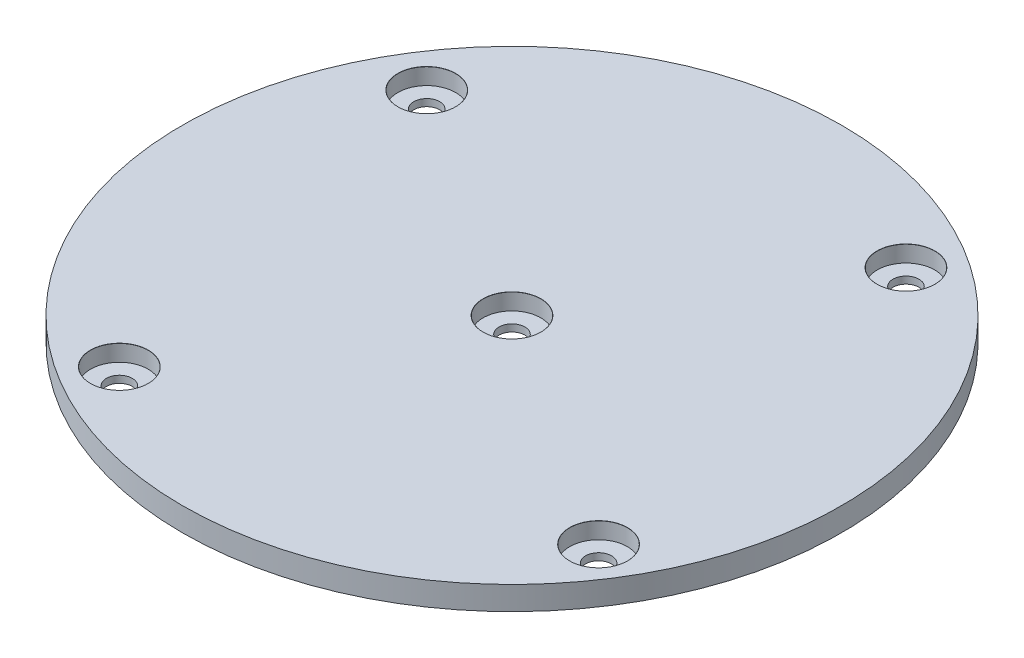
ISO-10303-21;
HEADER;
FILE_DESCRIPTION(('STEP AP214'),'2;1');
FILE_NAME('part.step','',(''),(''),'','','');
FILE_SCHEMA(('AUTOMOTIVE_DESIGN { 1 0 10303 214 1 1 1 1 }'));
ENDSEC;
DATA;
#1=APPLICATION_CONTEXT('core data for automotive mechanical design processes');
#2=APPLICATION_PROTOCOL_DEFINITION('international standard','automotive_design',2000,#1);
#3=PRODUCT_CONTEXT('',#1,'mechanical');
#4=PRODUCT('Part','Part','',(#3));
#5=PRODUCT_RELATED_PRODUCT_CATEGORY('part','',(#4));
#6=PRODUCT_DEFINITION_FORMATION('','',#4);
#7=PRODUCT_DEFINITION_CONTEXT('part definition',#1,'design');
#8=PRODUCT_DEFINITION('design','',#6,#7);
#9=PRODUCT_DEFINITION_SHAPE('','',#8);
#10=(LENGTH_UNIT() NAMED_UNIT(*) SI_UNIT(.MILLI.,.METRE.));
#11=(NAMED_UNIT(*) PLANE_ANGLE_UNIT() SI_UNIT($,.RADIAN.));
#12=(NAMED_UNIT(*) SI_UNIT($,.STERADIAN.) SOLID_ANGLE_UNIT());
#13=UNCERTAINTY_MEASURE_WITH_UNIT(LENGTH_MEASURE(1.E-05),#10,'distance_accuracy_value','');
#14=(GEOMETRIC_REPRESENTATION_CONTEXT(3) GLOBAL_UNCERTAINTY_ASSIGNED_CONTEXT((#13)) GLOBAL_UNIT_ASSIGNED_CONTEXT((#10,
#11,#12)) REPRESENTATION_CONTEXT('',''));
#15=CARTESIAN_POINT('',(0.,0.,0.));
#16=DIRECTION('',(0.,0.,1.));
#17=DIRECTION('',(1.,0.,0.));
#18=AXIS2_PLACEMENT_3D('',#15,#16,#17);
#19=CARTESIAN_POINT('',(0.,5.,0.));
#20=DIRECTION('',(0.,-1.,0.));
#21=DIRECTION('',(0.,0.,-1.));
#22=AXIS2_PLACEMENT_3D('',#19,#20,#21);
#23=CYLINDRICAL_SURFACE('',#22,70.);
#24=CARTESIAN_POINT('',(0.,5.,0.));
#25=DIRECTION('',(0.,1.,0.));
#26=DIRECTION('',(0.,0.,1.));
#27=AXIS2_PLACEMENT_3D('',#24,#25,#26);
#28=CIRCLE('',#27,70.);
#29=CARTESIAN_POINT('',(0.,5.,70.));
#30=VERTEX_POINT('',#29);
#31=EDGE_CURVE('E10',#30,#30,#28,.T.);
#32=ORIENTED_EDGE('',*,*,#31,.F.);
#33=EDGE_LOOP('',(#32));
#34=FACE_BOUND('',#33,.T.);
#35=CARTESIAN_POINT('',(0.,0.,0.));
#36=DIRECTION('',(0.,1.,0.));
#37=DIRECTION('',(0.,0.,1.));
#38=AXIS2_PLACEMENT_3D('',#35,#36,#37);
#39=CIRCLE('',#38,70.);
#40=CARTESIAN_POINT('',(0.,0.,70.));
#41=VERTEX_POINT('',#40);
#42=EDGE_CURVE('E40',#41,#41,#39,.T.);
#43=ORIENTED_EDGE('',*,*,#42,.T.);
#44=EDGE_LOOP('',(#43));
#45=FACE_BOUND('',#44,.T.);
#46=ADVANCED_FACE('F37',(#34,#45),#23,.T.);
#47=CARTESIAN_POINT('',(0.,5.,0.));
#48=DIRECTION('',(0.,1.,0.));
#49=DIRECTION('',(0.,0.,1.));
#50=AXIS2_PLACEMENT_3D('',#47,#48,#49);
#51=PLANE('',#50);
#52=CARTESIAN_POINT('',(0.,5.,0.));
#53=DIRECTION('',(0.,1.,0.));
#54=DIRECTION('',(0.,0.,1.));
#55=AXIS2_PLACEMENT_3D('',#52,#53,#54);
#56=CIRCLE('',#55,6.144);
#57=CARTESIAN_POINT('',(0.,5.,6.144));
#58=VERTEX_POINT('',#57);
#59=EDGE_CURVE('E120',#58,#58,#56,.T.);
#60=ORIENTED_EDGE('',*,*,#59,.F.);
#61=EDGE_LOOP('',(#60));
#62=FACE_BOUND('',#61,.T.);
#63=CARTESIAN_POINT('',(33.0392274204938,5.,-50.6432777799071));
#64=DIRECTION('',(0.,1.,0.));
#65=DIRECTION('',(0.,0.,1.));
#66=AXIS2_PLACEMENT_3D('',#63,#64,#65);
#67=CIRCLE('',#66,6.144);
#68=CARTESIAN_POINT('',(33.0392274204938,5.,-44.4992777799071));
#69=VERTEX_POINT('',#68);
#70=EDGE_CURVE('E105',#69,#69,#67,.T.);
#71=ORIENTED_EDGE('',*,*,#70,.F.);
#72=EDGE_LOOP('',(#71));
#73=FACE_BOUND('',#72,.T.);
#74=CARTESIAN_POINT('',(51.2868700670209,5.,32.8986507990891));
#75=DIRECTION('',(0.,1.,0.));
#76=DIRECTION('',(0.,0.,1.));
#77=AXIS2_PLACEMENT_3D('',#74,#75,#76);
#78=CIRCLE('',#77,6.144);
#79=CARTESIAN_POINT('',(51.2868700670209,5.,39.0426507990891));
#80=VERTEX_POINT('',#79);
#81=EDGE_CURVE('E90',#80,#80,#78,.T.);
#82=ORIENTED_EDGE('',*,*,#81,.F.);
#83=EDGE_LOOP('',(#82));
#84=FACE_BOUND('',#83,.T.);
#85=CARTESIAN_POINT('',(-32.2550585119747,5.,51.1462934456157));
#86=DIRECTION('',(0.,1.,0.));
#87=DIRECTION('',(0.,0.,1.));
#88=AXIS2_PLACEMENT_3D('',#85,#86,#87);
#89=CIRCLE('',#88,6.144);
#90=CARTESIAN_POINT('',(-32.2550585119747,5.,57.2902934456157));
#91=VERTEX_POINT('',#90);
#92=EDGE_CURVE('E75',#91,#91,#89,.T.);
#93=ORIENTED_EDGE('',*,*,#92,.F.);
#94=EDGE_LOOP('',(#93));
#95=FACE_BOUND('',#94,.T.);
#96=CARTESIAN_POINT('',(-50.5027011585014,5.,-32.3956351333802));
#97=DIRECTION('',(0.,1.,0.));
#98=DIRECTION('',(0.,0.,1.));
#99=AXIS2_PLACEMENT_3D('',#96,#97,#98);
#100=CIRCLE('',#99,6.144);
#101=CARTESIAN_POINT('',(-50.5027011585014,5.,-26.2516351333802));
#102=VERTEX_POINT('',#101);
#103=EDGE_CURVE('E60',#102,#102,#100,.T.);
#104=ORIENTED_EDGE('',*,*,#103,.F.);
#105=EDGE_LOOP('',(#104));
#106=FACE_BOUND('',#105,.T.);
#107=ORIENTED_EDGE('',*,*,#31,.T.);
#108=EDGE_LOOP('',(#107));
#109=FACE_BOUND('',#108,.T.);
#110=ADVANCED_FACE('F126',(#62,#73,#84,#95,#106,#109),#51,.T.);
#111=CARTESIAN_POINT('',(0.,0.,0.));
#112=DIRECTION('',(0.,1.,0.));
#113=DIRECTION('',(0.,0.,1.));
#114=AXIS2_PLACEMENT_3D('',#111,#112,#113);
#115=PLANE('',#114);
#116=CARTESIAN_POINT('',(0.,0.,0.));
#117=DIRECTION('',(0.,1.,0.));
#118=DIRECTION('',(0.,0.,1.));
#119=AXIS2_PLACEMENT_3D('',#116,#117,#118);
#120=CIRCLE('',#119,2.75);
#121=CARTESIAN_POINT('',(0.,0.,2.75));
#122=VERTEX_POINT('',#121);
#123=EDGE_CURVE('E108',#122,#122,#120,.T.);
#124=ORIENTED_EDGE('',*,*,#123,.T.);
#125=EDGE_LOOP('',(#124));
#126=FACE_BOUND('',#125,.T.);
#127=CARTESIAN_POINT('',(33.0392274204938,0.,-50.6432777799071));
#128=DIRECTION('',(0.,1.,0.));
#129=DIRECTION('',(0.,0.,1.));
#130=AXIS2_PLACEMENT_3D('',#127,#128,#129);
#131=CIRCLE('',#130,2.75);
#132=CARTESIAN_POINT('',(33.0392274204938,0.,-47.8932777799071));
#133=VERTEX_POINT('',#132);
#134=EDGE_CURVE('E93',#133,#133,#131,.T.);
#135=ORIENTED_EDGE('',*,*,#134,.T.);
#136=EDGE_LOOP('',(#135));
#137=FACE_BOUND('',#136,.T.);
#138=CARTESIAN_POINT('',(51.2868700670209,0.,32.8986507990891));
#139=DIRECTION('',(0.,1.,0.));
#140=DIRECTION('',(0.,0.,1.));
#141=AXIS2_PLACEMENT_3D('',#138,#139,#140);
#142=CIRCLE('',#141,2.75);
#143=CARTESIAN_POINT('',(51.2868700670209,0.,35.6486507990891));
#144=VERTEX_POINT('',#143);
#145=EDGE_CURVE('E78',#144,#144,#142,.T.);
#146=ORIENTED_EDGE('',*,*,#145,.T.);
#147=EDGE_LOOP('',(#146));
#148=FACE_BOUND('',#147,.T.);
#149=CARTESIAN_POINT('',(-32.2550585119747,0.,51.1462934456157));
#150=DIRECTION('',(0.,1.,0.));
#151=DIRECTION('',(0.,0.,1.));
#152=AXIS2_PLACEMENT_3D('',#149,#150,#151);
#153=CIRCLE('',#152,2.75);
#154=CARTESIAN_POINT('',(-32.2550585119747,0.,53.8962934456157));
#155=VERTEX_POINT('',#154);
#156=EDGE_CURVE('E63',#155,#155,#153,.T.);
#157=ORIENTED_EDGE('',*,*,#156,.T.);
#158=EDGE_LOOP('',(#157));
#159=FACE_BOUND('',#158,.T.);
#160=CARTESIAN_POINT('',(-50.5027011585014,0.,-32.3956351333802));
#161=DIRECTION('',(0.,1.,0.));
#162=DIRECTION('',(0.,0.,1.));
#163=AXIS2_PLACEMENT_3D('',#160,#161,#162);
#164=CIRCLE('',#163,2.75);
#165=CARTESIAN_POINT('',(-50.5027011585014,0.,-29.6456351333802));
#166=VERTEX_POINT('',#165);
#167=EDGE_CURVE('E47',#166,#166,#164,.T.);
#168=ORIENTED_EDGE('',*,*,#167,.T.);
#169=EDGE_LOOP('',(#168));
#170=FACE_BOUND('',#169,.T.);
#171=ORIENTED_EDGE('',*,*,#42,.F.);
#172=EDGE_LOOP('',(#171));
#173=FACE_BOUND('',#172,.T.);
#174=ADVANCED_FACE('F129',(#126,#137,#148,#159,#170,#173),#115,.F.);
#175=CARTESIAN_POINT('',(-50.5027011585014,5.,-32.3956351333802));
#176=DIRECTION('',(0.,1.,0.));
#177=DIRECTION('',(0.,0.,1.));
#178=AXIS2_PLACEMENT_3D('',#175,#176,#177);
#179=CYLINDRICAL_SURFACE('',#178,2.75);
#180=ORIENTED_EDGE('',*,*,#167,.F.);
#181=EDGE_LOOP('',(#180));
#182=FACE_BOUND('',#181,.T.);
#183=CARTESIAN_POINT('',(-50.5027011585014,1.5,-32.3956351333802));
#184=DIRECTION('',(0.,1.,0.));
#185=DIRECTION('',(0.,0.,1.));
#186=AXIS2_PLACEMENT_3D('',#183,#184,#185);
#187=CIRCLE('',#186,2.75);
#188=CARTESIAN_POINT('',(-50.5027011585014,1.5,-29.6456351333802));
#189=VERTEX_POINT('',#188);
#190=EDGE_CURVE('E51',#189,#189,#187,.T.);
#191=ORIENTED_EDGE('',*,*,#190,.T.);
#192=EDGE_LOOP('',(#191));
#193=FACE_BOUND('',#192,.T.);
#194=ADVANCED_FACE('F165',(#182,#193),#179,.F.);
#195=CARTESIAN_POINT('',(-44.3837011585014,1.5,-32.3956351333802));
#196=DIRECTION('',(0.,-1.,0.));
#197=DIRECTION('',(0.,0.,-1.));
#198=AXIS2_PLACEMENT_3D('',#195,#196,#197);
#199=PLANE('',#198);
#200=ORIENTED_EDGE('',*,*,#190,.F.);
#201=EDGE_LOOP('',(#200));
#202=FACE_BOUND('',#201,.T.);
#203=CARTESIAN_POINT('',(-50.5027011585014,1.5,-32.3956351333802));
#204=DIRECTION('',(0.,1.,0.));
#205=DIRECTION('',(0.,0.,1.));
#206=AXIS2_PLACEMENT_3D('',#203,#204,#205);
#207=CIRCLE('',#206,6.119);
#208=CARTESIAN_POINT('',(-50.5027011585014,1.5,-26.2766351333802));
#209=VERTEX_POINT('',#208);
#210=EDGE_CURVE('E54',#209,#209,#207,.T.);
#211=ORIENTED_EDGE('',*,*,#210,.T.);
#212=EDGE_LOOP('',(#211));
#213=FACE_BOUND('',#212,.T.);
#214=ADVANCED_FACE('F152',(#202,#213),#199,.F.);
#215=CARTESIAN_POINT('',(-50.5027011585014,5.,-32.3956351333802));
#216=DIRECTION('',(0.,1.,0.));
#217=DIRECTION('',(0.,0.,1.));
#218=AXIS2_PLACEMENT_3D('',#215,#216,#217);
#219=CYLINDRICAL_SURFACE('',#218,6.119);
#220=ORIENTED_EDGE('',*,*,#210,.F.);
#221=EDGE_LOOP('',(#220));
#222=FACE_BOUND('',#221,.T.);
#223=CARTESIAN_POINT('',(-50.5027011585014,4.975,-32.3956351333802));
#224=DIRECTION('',(0.,1.,0.));
#225=DIRECTION('',(0.,0.,1.));
#226=AXIS2_PLACEMENT_3D('',#223,#224,#225);
#227=CIRCLE('',#226,6.119);
#228=CARTESIAN_POINT('',(-50.5027011585014,4.975,-26.2766351333802));
#229=VERTEX_POINT('',#228);
#230=EDGE_CURVE('E57',#229,#229,#227,.T.);
#231=ORIENTED_EDGE('',*,*,#230,.T.);
#232=EDGE_LOOP('',(#231));
#233=FACE_BOUND('',#232,.T.);
#234=ADVANCED_FACE('F142',(#222,#233),#219,.F.);
#235=CARTESIAN_POINT('',(-50.5027011585014,5.,-32.3956351333802));
#236=DIRECTION('',(0.,1.,0.));
#237=DIRECTION('',(0.,0.,1.));
#238=AXIS2_PLACEMENT_3D('',#235,#236,#237);
#239=CONICAL_SURFACE('',#238,6.144,0.785398163397431);
#240=ORIENTED_EDGE('',*,*,#230,.F.);
#241=EDGE_LOOP('',(#240));
#242=FACE_BOUND('',#241,.T.);
#243=ORIENTED_EDGE('',*,*,#103,.T.);
#244=EDGE_LOOP('',(#243));
#245=FACE_BOUND('',#244,.T.);
#246=ADVANCED_FACE('F139',(#242,#245),#239,.F.);
#247=CARTESIAN_POINT('',(-32.2550585119747,5.,51.1462934456157));
#248=DIRECTION('',(0.,1.,0.));
#249=DIRECTION('',(0.,0.,1.));
#250=AXIS2_PLACEMENT_3D('',#247,#248,#249);
#251=CYLINDRICAL_SURFACE('',#250,2.75);
#252=ORIENTED_EDGE('',*,*,#156,.F.);
#253=EDGE_LOOP('',(#252));
#254=FACE_BOUND('',#253,.T.);
#255=CARTESIAN_POINT('',(-32.2550585119747,1.5,51.1462934456157));
#256=DIRECTION('',(0.,1.,0.));
#257=DIRECTION('',(0.,0.,1.));
#258=AXIS2_PLACEMENT_3D('',#255,#256,#257);
#259=CIRCLE('',#258,2.75);
#260=CARTESIAN_POINT('',(-32.2550585119747,1.5,53.8962934456157));
#261=VERTEX_POINT('',#260);
#262=EDGE_CURVE('E66',#261,#261,#259,.T.);
#263=ORIENTED_EDGE('',*,*,#262,.T.);
#264=EDGE_LOOP('',(#263));
#265=FACE_BOUND('',#264,.T.);
#266=ADVANCED_FACE('F141',(#254,#265),#251,.F.);
#267=CARTESIAN_POINT('',(-26.1360585119747,1.5,51.1462934456157));
#268=DIRECTION('',(0.,-1.,0.));
#269=DIRECTION('',(0.,0.,-1.));
#270=AXIS2_PLACEMENT_3D('',#267,#268,#269);
#271=PLANE('',#270);
#272=ORIENTED_EDGE('',*,*,#262,.F.);
#273=EDGE_LOOP('',(#272));
#274=FACE_BOUND('',#273,.T.);
#275=CARTESIAN_POINT('',(-32.2550585119747,1.5,51.1462934456157));
#276=DIRECTION('',(0.,1.,0.));
#277=DIRECTION('',(0.,0.,1.));
#278=AXIS2_PLACEMENT_3D('',#275,#276,#277);
#279=CIRCLE('',#278,6.119);
#280=CARTESIAN_POINT('',(-32.2550585119747,1.5,57.2652934456157));
#281=VERTEX_POINT('',#280);
#282=EDGE_CURVE('E69',#281,#281,#279,.T.);
#283=ORIENTED_EDGE('',*,*,#282,.T.);
#284=EDGE_LOOP('',(#283));
#285=FACE_BOUND('',#284,.T.);
#286=ADVANCED_FACE('F149',(#274,#285),#271,.F.);
#287=CARTESIAN_POINT('',(-32.2550585119747,5.,51.1462934456157));
#288=DIRECTION('',(0.,1.,0.));
#289=DIRECTION('',(0.,0.,1.));
#290=AXIS2_PLACEMENT_3D('',#287,#288,#289);
#291=CYLINDRICAL_SURFACE('',#290,6.119);
#292=ORIENTED_EDGE('',*,*,#282,.F.);
#293=EDGE_LOOP('',(#292));
#294=FACE_BOUND('',#293,.T.);
#295=CARTESIAN_POINT('',(-32.2550585119747,4.975,51.1462934456157));
#296=DIRECTION('',(0.,1.,0.));
#297=DIRECTION('',(0.,0.,1.));
#298=AXIS2_PLACEMENT_3D('',#295,#296,#297);
#299=CIRCLE('',#298,6.119);
#300=CARTESIAN_POINT('',(-32.2550585119747,4.975,57.2652934456157));
#301=VERTEX_POINT('',#300);
#302=EDGE_CURVE('E72',#301,#301,#299,.T.);
#303=ORIENTED_EDGE('',*,*,#302,.T.);
#304=EDGE_LOOP('',(#303));
#305=FACE_BOUND('',#304,.T.);
#306=ADVANCED_FACE('F210',(#294,#305),#291,.F.);
#307=CARTESIAN_POINT('',(-32.2550585119747,5.,51.1462934456157));
#308=DIRECTION('',(0.,1.,0.));
#309=DIRECTION('',(0.,0.,1.));
#310=AXIS2_PLACEMENT_3D('',#307,#308,#309);
#311=CONICAL_SURFACE('',#310,6.144,0.785398163397431);
#312=ORIENTED_EDGE('',*,*,#302,.F.);
#313=EDGE_LOOP('',(#312));
#314=FACE_BOUND('',#313,.T.);
#315=ORIENTED_EDGE('',*,*,#92,.T.);
#316=EDGE_LOOP('',(#315));
#317=FACE_BOUND('',#316,.T.);
#318=ADVANCED_FACE('F220',(#314,#317),#311,.F.);
#319=CARTESIAN_POINT('',(51.2868700670209,5.,32.8986507990891));
#320=DIRECTION('',(0.,1.,0.));
#321=DIRECTION('',(0.,0.,1.));
#322=AXIS2_PLACEMENT_3D('',#319,#320,#321);
#323=CYLINDRICAL_SURFACE('',#322,2.75);
#324=ORIENTED_EDGE('',*,*,#145,.F.);
#325=EDGE_LOOP('',(#324));
#326=FACE_BOUND('',#325,.T.);
#327=CARTESIAN_POINT('',(51.2868700670209,1.5,32.8986507990891));
#328=DIRECTION('',(0.,1.,0.));
#329=DIRECTION('',(0.,0.,1.));
#330=AXIS2_PLACEMENT_3D('',#327,#328,#329);
#331=CIRCLE('',#330,2.75);
#332=CARTESIAN_POINT('',(51.2868700670209,1.5,35.6486507990891));
#333=VERTEX_POINT('',#332);
#334=EDGE_CURVE('E81',#333,#333,#331,.T.);
#335=ORIENTED_EDGE('',*,*,#334,.T.);
#336=EDGE_LOOP('',(#335));
#337=FACE_BOUND('',#336,.T.);
#338=ADVANCED_FACE('F230',(#326,#337),#323,.F.);
#339=CARTESIAN_POINT('',(57.4058700670209,1.5,32.8986507990891));
#340=DIRECTION('',(0.,-1.,0.));
#341=DIRECTION('',(0.,0.,-1.));
#342=AXIS2_PLACEMENT_3D('',#339,#340,#341);
#343=PLANE('',#342);
#344=ORIENTED_EDGE('',*,*,#334,.F.);
#345=EDGE_LOOP('',(#344));
#346=FACE_BOUND('',#345,.T.);
#347=CARTESIAN_POINT('',(51.2868700670209,1.5,32.8986507990891));
#348=DIRECTION('',(0.,1.,0.));
#349=DIRECTION('',(0.,0.,1.));
#350=AXIS2_PLACEMENT_3D('',#347,#348,#349);
#351=CIRCLE('',#350,6.119);
#352=CARTESIAN_POINT('',(51.2868700670209,1.5,39.0176507990891));
#353=VERTEX_POINT('',#352);
#354=EDGE_CURVE('E84',#353,#353,#351,.T.);
#355=ORIENTED_EDGE('',*,*,#354,.T.);
#356=EDGE_LOOP('',(#355));
#357=FACE_BOUND('',#356,.T.);
#358=ADVANCED_FACE('F240',(#346,#357),#343,.F.);
#359=CARTESIAN_POINT('',(51.2868700670209,5.,32.8986507990891));
#360=DIRECTION('',(0.,1.,0.));
#361=DIRECTION('',(0.,0.,1.));
#362=AXIS2_PLACEMENT_3D('',#359,#360,#361);
#363=CYLINDRICAL_SURFACE('',#362,6.119);
#364=ORIENTED_EDGE('',*,*,#354,.F.);
#365=EDGE_LOOP('',(#364));
#366=FACE_BOUND('',#365,.T.);
#367=CARTESIAN_POINT('',(51.2868700670209,4.975,32.8986507990891));
#368=DIRECTION('',(0.,1.,0.));
#369=DIRECTION('',(0.,0.,1.));
#370=AXIS2_PLACEMENT_3D('',#367,#368,#369);
#371=CIRCLE('',#370,6.119);
#372=CARTESIAN_POINT('',(51.2868700670209,4.975,39.0176507990891));
#373=VERTEX_POINT('',#372);
#374=EDGE_CURVE('E87',#373,#373,#371,.T.);
#375=ORIENTED_EDGE('',*,*,#374,.T.);
#376=EDGE_LOOP('',(#375));
#377=FACE_BOUND('',#376,.T.);
#378=ADVANCED_FACE('F250',(#366,#377),#363,.F.);
#379=CARTESIAN_POINT('',(51.2868700670209,5.,32.8986507990891));
#380=DIRECTION('',(0.,1.,0.));
#381=DIRECTION('',(0.,0.,1.));
#382=AXIS2_PLACEMENT_3D('',#379,#380,#381);
#383=CONICAL_SURFACE('',#382,6.144,0.78539816339757);
#384=ORIENTED_EDGE('',*,*,#374,.F.);
#385=EDGE_LOOP('',(#384));
#386=FACE_BOUND('',#385,.T.);
#387=ORIENTED_EDGE('',*,*,#81,.T.);
#388=EDGE_LOOP('',(#387));
#389=FACE_BOUND('',#388,.T.);
#390=ADVANCED_FACE('F260',(#386,#389),#383,.F.);
#391=CARTESIAN_POINT('',(33.0392274204938,5.,-50.6432777799071));
#392=DIRECTION('',(0.,1.,0.));
#393=DIRECTION('',(0.,0.,1.));
#394=AXIS2_PLACEMENT_3D('',#391,#392,#393);
#395=CYLINDRICAL_SURFACE('',#394,2.75);
#396=ORIENTED_EDGE('',*,*,#134,.F.);
#397=EDGE_LOOP('',(#396));
#398=FACE_BOUND('',#397,.T.);
#399=CARTESIAN_POINT('',(33.0392274204938,1.5,-50.6432777799071));
#400=DIRECTION('',(0.,1.,0.));
#401=DIRECTION('',(0.,0.,1.));
#402=AXIS2_PLACEMENT_3D('',#399,#400,#401);
#403=CIRCLE('',#402,2.75);
#404=CARTESIAN_POINT('',(33.0392274204938,1.5,-47.8932777799071));
#405=VERTEX_POINT('',#404);
#406=EDGE_CURVE('E96',#405,#405,#403,.T.);
#407=ORIENTED_EDGE('',*,*,#406,.T.);
#408=EDGE_LOOP('',(#407));
#409=FACE_BOUND('',#408,.T.);
#410=ADVANCED_FACE('F270',(#398,#409),#395,.F.);
#411=CARTESIAN_POINT('',(39.1582274204938,1.5,-50.6432777799071));
#412=DIRECTION('',(0.,-1.,0.));
#413=DIRECTION('',(0.,0.,-1.));
#414=AXIS2_PLACEMENT_3D('',#411,#412,#413);
#415=PLANE('',#414);
#416=ORIENTED_EDGE('',*,*,#406,.F.);
#417=EDGE_LOOP('',(#416));
#418=FACE_BOUND('',#417,.T.);
#419=CARTESIAN_POINT('',(33.0392274204938,1.5,-50.6432777799071));
#420=DIRECTION('',(0.,1.,0.));
#421=DIRECTION('',(0.,0.,1.));
#422=AXIS2_PLACEMENT_3D('',#419,#420,#421);
#423=CIRCLE('',#422,6.119);
#424=CARTESIAN_POINT('',(33.0392274204938,1.5,-44.5242777799071));
#425=VERTEX_POINT('',#424);
#426=EDGE_CURVE('E99',#425,#425,#423,.T.);
#427=ORIENTED_EDGE('',*,*,#426,.T.);
#428=EDGE_LOOP('',(#427));
#429=FACE_BOUND('',#428,.T.);
#430=ADVANCED_FACE('F280',(#418,#429),#415,.F.);
#431=CARTESIAN_POINT('',(33.0392274204938,5.,-50.6432777799071));
#432=DIRECTION('',(0.,1.,0.));
#433=DIRECTION('',(0.,0.,1.));
#434=AXIS2_PLACEMENT_3D('',#431,#432,#433);
#435=CYLINDRICAL_SURFACE('',#434,6.119);
#436=ORIENTED_EDGE('',*,*,#426,.F.);
#437=EDGE_LOOP('',(#436));
#438=FACE_BOUND('',#437,.T.);
#439=CARTESIAN_POINT('',(33.0392274204938,4.975,-50.6432777799071));
#440=DIRECTION('',(0.,1.,0.));
#441=DIRECTION('',(0.,0.,1.));
#442=AXIS2_PLACEMENT_3D('',#439,#440,#441);
#443=CIRCLE('',#442,6.119);
#444=CARTESIAN_POINT('',(33.0392274204938,4.975,-44.5242777799071));
#445=VERTEX_POINT('',#444);
#446=EDGE_CURVE('E102',#445,#445,#443,.T.);
#447=ORIENTED_EDGE('',*,*,#446,.T.);
#448=EDGE_LOOP('',(#447));
#449=FACE_BOUND('',#448,.T.);
#450=ADVANCED_FACE('F290',(#438,#449),#435,.F.);
#451=CARTESIAN_POINT('',(33.0392274204938,5.,-50.6432777799071));
#452=DIRECTION('',(0.,1.,0.));
#453=DIRECTION('',(0.,0.,1.));
#454=AXIS2_PLACEMENT_3D('',#451,#452,#453);
#455=CONICAL_SURFACE('',#454,6.144,0.78539816339757);
#456=ORIENTED_EDGE('',*,*,#446,.F.);
#457=EDGE_LOOP('',(#456));
#458=FACE_BOUND('',#457,.T.);
#459=ORIENTED_EDGE('',*,*,#70,.T.);
#460=EDGE_LOOP('',(#459));
#461=FACE_BOUND('',#460,.T.);
#462=ADVANCED_FACE('F300',(#458,#461),#455,.F.);
#463=CARTESIAN_POINT('',(0.,5.,0.));
#464=DIRECTION('',(0.,1.,0.));
#465=DIRECTION('',(0.,0.,1.));
#466=AXIS2_PLACEMENT_3D('',#463,#464,#465);
#467=CYLINDRICAL_SURFACE('',#466,2.75);
#468=ORIENTED_EDGE('',*,*,#123,.F.);
#469=EDGE_LOOP('',(#468));
#470=FACE_BOUND('',#469,.T.);
#471=CARTESIAN_POINT('',(0.,1.5,0.));
#472=DIRECTION('',(0.,1.,0.));
#473=DIRECTION('',(0.,0.,1.));
#474=AXIS2_PLACEMENT_3D('',#471,#472,#473);
#475=CIRCLE('',#474,2.75);
#476=CARTESIAN_POINT('',(0.,1.5,2.75));
#477=VERTEX_POINT('',#476);
#478=EDGE_CURVE('E111',#477,#477,#475,.T.);
#479=ORIENTED_EDGE('',*,*,#478,.T.);
#480=EDGE_LOOP('',(#479));
#481=FACE_BOUND('',#480,.T.);
#482=ADVANCED_FACE('F310',(#470,#481),#467,.F.);
#483=CARTESIAN_POINT('',(6.119,1.5,0.));
#484=DIRECTION('',(0.,-1.,0.));
#485=DIRECTION('',(0.,0.,-1.));
#486=AXIS2_PLACEMENT_3D('',#483,#484,#485);
#487=PLANE('',#486);
#488=ORIENTED_EDGE('',*,*,#478,.F.);
#489=EDGE_LOOP('',(#488));
#490=FACE_BOUND('',#489,.T.);
#491=CARTESIAN_POINT('',(0.,1.5,0.));
#492=DIRECTION('',(0.,1.,0.));
#493=DIRECTION('',(0.,0.,1.));
#494=AXIS2_PLACEMENT_3D('',#491,#492,#493);
#495=CIRCLE('',#494,6.119);
#496=CARTESIAN_POINT('',(0.,1.5,6.119));
#497=VERTEX_POINT('',#496);
#498=EDGE_CURVE('E114',#497,#497,#495,.T.);
#499=ORIENTED_EDGE('',*,*,#498,.T.);
#500=EDGE_LOOP('',(#499));
#501=FACE_BOUND('',#500,.T.);
#502=ADVANCED_FACE('F319',(#490,#501),#487,.F.);
#503=CARTESIAN_POINT('',(0.,5.,0.));
#504=DIRECTION('',(0.,1.,0.));
#505=DIRECTION('',(0.,0.,1.));
#506=AXIS2_PLACEMENT_3D('',#503,#504,#505);
#507=CYLINDRICAL_SURFACE('',#506,6.119);
#508=ORIENTED_EDGE('',*,*,#498,.F.);
#509=EDGE_LOOP('',(#508));
#510=FACE_BOUND('',#509,.T.);
#511=CARTESIAN_POINT('',(0.,4.975,0.));
#512=DIRECTION('',(0.,1.,0.));
#513=DIRECTION('',(0.,0.,1.));
#514=AXIS2_PLACEMENT_3D('',#511,#512,#513);
#515=CIRCLE('',#514,6.119);
#516=CARTESIAN_POINT('',(0.,4.975,6.119));
#517=VERTEX_POINT('',#516);
#518=EDGE_CURVE('E117',#517,#517,#515,.T.);
#519=ORIENTED_EDGE('',*,*,#518,.T.);
#520=EDGE_LOOP('',(#519));
#521=FACE_BOUND('',#520,.T.);
#522=ADVANCED_FACE('F329',(#510,#521),#507,.F.);
#523=CARTESIAN_POINT('',(0.,5.,0.));
#524=DIRECTION('',(0.,1.,0.));
#525=DIRECTION('',(0.,0.,1.));
#526=AXIS2_PLACEMENT_3D('',#523,#524,#525);
#527=CONICAL_SURFACE('',#526,6.144,0.785398163397448);
#528=ORIENTED_EDGE('',*,*,#518,.F.);
#529=EDGE_LOOP('',(#528));
#530=FACE_BOUND('',#529,.T.);
#531=ORIENTED_EDGE('',*,*,#59,.T.);
#532=EDGE_LOOP('',(#531));
#533=FACE_BOUND('',#532,.T.);
#534=ADVANCED_FACE('F124',(#530,#533),#527,.F.);
#535=CLOSED_SHELL('',(#46,#110,#174,#194,#214,#234,#246,#266,#286,#306,#318,#338,#358,#378,#390,
#410,#430,#450,#462,#482,#502,#522,#534));
#536=MANIFOLD_SOLID_BREP('B2',#535);
#537=ADVANCED_BREP_SHAPE_REPRESENTATION('',(#18,#536),#14);
#538=SHAPE_DEFINITION_REPRESENTATION(#9,#537);
ENDSEC;
END-ISO-10303-21;
